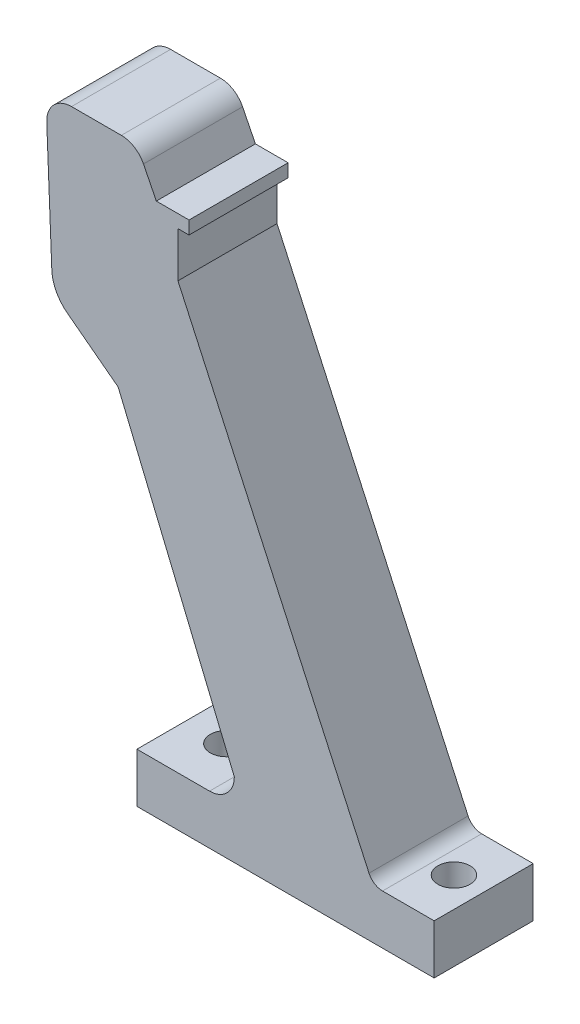
ISO-10303-21;
HEADER;
FILE_DESCRIPTION(('STEP AP214'),'2;1');
FILE_NAME('part.step','',(''),(''),'','','');
FILE_SCHEMA(('AUTOMOTIVE_DESIGN { 1 0 10303 214 1 1 1 1 }'));
ENDSEC;
DATA;
#1=APPLICATION_CONTEXT('core data for automotive mechanical design processes');
#2=APPLICATION_PROTOCOL_DEFINITION('international standard','automotive_design',2000,#1);
#3=PRODUCT_CONTEXT('',#1,'mechanical');
#4=PRODUCT('Part','Part','',(#3));
#5=PRODUCT_RELATED_PRODUCT_CATEGORY('part','',(#4));
#6=PRODUCT_DEFINITION_FORMATION('','',#4);
#7=PRODUCT_DEFINITION_CONTEXT('part definition',#1,'design');
#8=PRODUCT_DEFINITION('design','',#6,#7);
#9=PRODUCT_DEFINITION_SHAPE('','',#8);
#10=(LENGTH_UNIT() NAMED_UNIT(*) SI_UNIT(.MILLI.,.METRE.));
#11=(NAMED_UNIT(*) PLANE_ANGLE_UNIT() SI_UNIT($,.RADIAN.));
#12=(NAMED_UNIT(*) SI_UNIT($,.STERADIAN.) SOLID_ANGLE_UNIT());
#13=UNCERTAINTY_MEASURE_WITH_UNIT(LENGTH_MEASURE(1.E-05),#10,'distance_accuracy_value','');
#14=(GEOMETRIC_REPRESENTATION_CONTEXT(3) GLOBAL_UNCERTAINTY_ASSIGNED_CONTEXT((#13)) GLOBAL_UNIT_ASSIGNED_CONTEXT((#10,
#11,#12)) REPRESENTATION_CONTEXT('',''));
#15=CARTESIAN_POINT('',(0.,0.,0.));
#16=DIRECTION('',(0.,0.,1.));
#17=DIRECTION('',(1.,0.,0.));
#18=AXIS2_PLACEMENT_3D('',#15,#16,#17);
#19=CARTESIAN_POINT('',(-33.5766124042696,62.9247343392549,20.));
#20=DIRECTION('',(0.,-1.,0.));
#21=DIRECTION('',(0.,0.,-1.));
#22=AXIS2_PLACEMENT_3D('',#19,#20,#21);
#23=PLANE('',#22);
#24=DIRECTION('',(-1.,0.,0.));
#25=VECTOR('',#24,1.);
#26=CARTESIAN_POINT('',(-33.5766124042696,62.9247343392549,0.));
#27=LINE('',#26,#25);
#28=CARTESIAN_POINT('',(-33.5766124042696,62.9247343392549,0.));
#29=VERTEX_POINT('',#28);
#30=CARTESIAN_POINT('',(-40.1808506791248,62.9247343392549,0.));
#31=VERTEX_POINT('',#30);
#32=EDGE_CURVE('E202',#29,#31,#27,.T.);
#33=ORIENTED_EDGE('',*,*,#32,.T.);
#34=DIRECTION('',(0.,0.,-1.));
#35=VECTOR('',#34,1.);
#36=CARTESIAN_POINT('',(-40.1808506791248,62.9247343392549,20.));
#37=LINE('',#36,#35);
#38=CARTESIAN_POINT('',(-40.1808506791248,62.9247343392549,20.));
#39=VERTEX_POINT('',#38);
#40=EDGE_CURVE('E11',#39,#31,#37,.T.);
#41=ORIENTED_EDGE('',*,*,#40,.F.);
#42=DIRECTION('',(-1.,0.,0.));
#43=VECTOR('',#42,1.);
#44=CARTESIAN_POINT('',(-33.5766124042696,62.9247343392549,20.));
#45=LINE('',#44,#43);
#46=CARTESIAN_POINT('',(-33.5766124042696,62.9247343392549,20.));
#47=VERTEX_POINT('',#46);
#48=EDGE_CURVE('E242',#47,#39,#45,.T.);
#49=ORIENTED_EDGE('',*,*,#48,.F.);
#50=DIRECTION('',(0.,0.,-1.));
#51=VECTOR('',#50,1.);
#52=CARTESIAN_POINT('',(-33.5766124042696,62.9247343392549,20.));
#53=LINE('',#52,#51);
#54=EDGE_CURVE('E198',#47,#29,#53,.T.);
#55=ORIENTED_EDGE('',*,*,#54,.T.);
#56=EDGE_LOOP('',(#33,#41,#49,#55));
#57=FACE_BOUND('',#56,.T.);
#58=ADVANCED_FACE('F32',(#57),#23,.F.);
#59=CARTESIAN_POINT('',(-42.7703694840836,68.1179503494172,20.));
#60=DIRECTION('',(-0.894915312548847,-0.446236017557525,0.));
#61=DIRECTION('',(0.446236017557525,-0.894915312548847,0.));
#62=AXIS2_PLACEMENT_3D('',#59,#60,#61);
#63=PLANE('',#62);
#64=DIRECTION('',(-0.446236017557525,0.894915312548847,0.));
#65=VECTOR('',#64,1.);
#66=CARTESIAN_POINT('',(-42.7703694840836,68.1179503494172,0.));
#67=LINE('',#66,#65);
#68=CARTESIAN_POINT('',(-42.7703694840836,68.1179503494172,0.));
#69=VERTEX_POINT('',#68);
#70=EDGE_CURVE('E205',#31,#69,#67,.T.);
#71=ORIENTED_EDGE('',*,*,#70,.T.);
#72=DIRECTION('',(0.,0.,-1.));
#73=VECTOR('',#72,1.);
#74=CARTESIAN_POINT('',(-42.7703694840836,68.1179503494172,20.));
#75=LINE('',#74,#73);
#76=CARTESIAN_POINT('',(-42.7703694840836,68.1179503494172,20.));
#77=VERTEX_POINT('',#76);
#78=EDGE_CURVE('E41',#77,#69,#75,.T.);
#79=ORIENTED_EDGE('',*,*,#78,.F.);
#80=DIRECTION('',(-0.446236017557525,0.894915312548847,0.));
#81=VECTOR('',#80,1.);
#82=CARTESIAN_POINT('',(-42.7703694840836,68.1179503494172,20.));
#83=LINE('',#82,#81);
#84=EDGE_CURVE('E129',#39,#77,#83,.T.);
#85=ORIENTED_EDGE('',*,*,#84,.F.);
#86=ORIENTED_EDGE('',*,*,#40,.T.);
#87=EDGE_LOOP('',(#71,#79,#85,#86));
#88=FACE_BOUND('',#87,.T.);
#89=ADVANCED_FACE('F359',(#88),#63,.F.);
#90=CARTESIAN_POINT('',(-47.2449460468278,65.8867702616295,20.));
#91=DIRECTION('',(0.,0.,-1.));
#92=DIRECTION('',(-1.,0.,0.));
#93=AXIS2_PLACEMENT_3D('',#90,#91,#92);
#94=CYLINDRICAL_SURFACE('',#93,5.00000000000001);
#95=CARTESIAN_POINT('',(-47.2449460468278,65.8867702616295,0.));
#96=DIRECTION('',(0.,0.,1.));
#97=DIRECTION('',(-1.,0.,0.));
#98=AXIS2_PLACEMENT_3D('',#95,#96,#97);
#99=CIRCLE('',#98,5.00000000000001);
#100=CARTESIAN_POINT('',(-47.2449460468278,70.8867702616295,0.));
#101=VERTEX_POINT('',#100);
#102=EDGE_CURVE('E208',#69,#101,#99,.T.);
#103=ORIENTED_EDGE('',*,*,#102,.T.);
#104=DIRECTION('',(0.,0.,-1.));
#105=VECTOR('',#104,1.);
#106=CARTESIAN_POINT('',(-47.2449460468278,70.8867702616295,20.));
#107=LINE('',#106,#105);
#108=CARTESIAN_POINT('',(-47.2449460468278,70.8867702616295,20.));
#109=VERTEX_POINT('',#108);
#110=EDGE_CURVE('E285',#109,#101,#107,.T.);
#111=ORIENTED_EDGE('',*,*,#110,.F.);
#112=CARTESIAN_POINT('',(-47.2449460468278,65.8867702616295,20.));
#113=DIRECTION('',(0.,0.,1.));
#114=DIRECTION('',(-1.,0.,0.));
#115=AXIS2_PLACEMENT_3D('',#112,#113,#114);
#116=CIRCLE('',#115,5.00000000000001);
#117=EDGE_CURVE('E304',#77,#109,#116,.T.);
#118=ORIENTED_EDGE('',*,*,#117,.F.);
#119=ORIENTED_EDGE('',*,*,#78,.T.);
#120=EDGE_LOOP('',(#103,#111,#118,#119));
#121=FACE_BOUND('',#120,.T.);
#122=ADVANCED_FACE('F363',(#121),#94,.T.);
#123=CARTESIAN_POINT('',(-57.3006603126146,70.8867702616295,20.));
#124=DIRECTION('',(0.,-1.,0.));
#125=DIRECTION('',(0.,0.,-1.));
#126=AXIS2_PLACEMENT_3D('',#123,#124,#125);
#127=PLANE('',#126);
#128=DIRECTION('',(-1.,0.,0.));
#129=VECTOR('',#128,1.);
#130=CARTESIAN_POINT('',(-57.3006603126146,70.8867702616295,0.));
#131=LINE('',#130,#129);
#132=CARTESIAN_POINT('',(-57.3006603126146,70.8867702616295,0.));
#133=VERTEX_POINT('',#132);
#134=EDGE_CURVE('E210',#101,#133,#131,.T.);
#135=ORIENTED_EDGE('',*,*,#134,.T.);
#136=DIRECTION('',(0.,0.,-1.));
#137=VECTOR('',#136,1.);
#138=CARTESIAN_POINT('',(-57.3006603126146,70.8867702616295,20.));
#139=LINE('',#138,#137);
#140=CARTESIAN_POINT('',(-57.3006603126146,70.8867702616295,20.));
#141=VERTEX_POINT('',#140);
#142=EDGE_CURVE('E282',#141,#133,#139,.T.);
#143=ORIENTED_EDGE('',*,*,#142,.F.);
#144=DIRECTION('',(-1.,0.,0.));
#145=VECTOR('',#144,1.);
#146=CARTESIAN_POINT('',(-57.3006603126146,70.8867702616295,20.));
#147=LINE('',#146,#145);
#148=EDGE_CURVE('E306',#109,#141,#147,.T.);
#149=ORIENTED_EDGE('',*,*,#148,.F.);
#150=ORIENTED_EDGE('',*,*,#110,.T.);
#151=EDGE_LOOP('',(#135,#143,#149,#150));
#152=FACE_BOUND('',#151,.T.);
#153=ADVANCED_FACE('F367',(#152),#127,.F.);
#154=CARTESIAN_POINT('',(-57.3006603126146,65.8867702616295,20.));
#155=DIRECTION('',(0.,0.,-1.));
#156=DIRECTION('',(-1.,0.,0.));
#157=AXIS2_PLACEMENT_3D('',#154,#155,#156);
#158=CYLINDRICAL_SURFACE('',#157,5.);
#159=CARTESIAN_POINT('',(-57.3006603126146,65.8867702616295,0.));
#160=DIRECTION('',(0.,0.,1.));
#161=DIRECTION('',(-1.,0.,0.));
#162=AXIS2_PLACEMENT_3D('',#159,#160,#161);
#163=CIRCLE('',#162,5.);
#164=CARTESIAN_POINT('',(-62.2966311792775,65.6860836914358,0.));
#165=VERTEX_POINT('',#164);
#166=EDGE_CURVE('E212',#133,#165,#163,.T.);
#167=ORIENTED_EDGE('',*,*,#166,.T.);
#168=DIRECTION('',(0.,0.,-1.));
#169=VECTOR('',#168,1.);
#170=CARTESIAN_POINT('',(-62.2966311792775,65.6860836914358,20.));
#171=LINE('',#170,#169);
#172=CARTESIAN_POINT('',(-62.2966311792775,65.6860836914358,20.));
#173=VERTEX_POINT('',#172);
#174=EDGE_CURVE('E279',#173,#165,#171,.T.);
#175=ORIENTED_EDGE('',*,*,#174,.F.);
#176=CARTESIAN_POINT('',(-57.3006603126146,65.8867702616295,20.));
#177=DIRECTION('',(0.,0.,1.));
#178=DIRECTION('',(-1.,0.,0.));
#179=AXIS2_PLACEMENT_3D('',#176,#177,#178);
#180=CIRCLE('',#179,5.);
#181=EDGE_CURVE('E308',#141,#173,#180,.T.);
#182=ORIENTED_EDGE('',*,*,#181,.F.);
#183=ORIENTED_EDGE('',*,*,#142,.T.);
#184=EDGE_LOOP('',(#167,#175,#182,#183));
#185=FACE_BOUND('',#184,.T.);
#186=ADVANCED_FACE('F373',(#185),#158,.T.);
#187=CARTESIAN_POINT('',(-61.2932112276318,40.7065504789688,20.));
#188=DIRECTION('',(0.999194173332569,0.0401373140387434,0.));
#189=DIRECTION('',(-0.0401373140387434,0.999194173332569,0.));
#190=AXIS2_PLACEMENT_3D('',#187,#188,#189);
#191=PLANE('',#190);
#192=DIRECTION('',(0.0401373140387434,-0.999194173332569,0.));
#193=VECTOR('',#192,1.);
#194=CARTESIAN_POINT('',(-61.2932112276318,40.7065504789688,0.));
#195=LINE('',#194,#193);
#196=CARTESIAN_POINT('',(-61.2932112276318,40.7065504789688,0.));
#197=VERTEX_POINT('',#196);
#198=EDGE_CURVE('E214',#165,#197,#195,.T.);
#199=ORIENTED_EDGE('',*,*,#198,.T.);
#200=DIRECTION('',(0.,0.,-1.));
#201=VECTOR('',#200,1.);
#202=CARTESIAN_POINT('',(-61.2932112276318,40.7065504789688,20.));
#203=LINE('',#202,#201);
#204=CARTESIAN_POINT('',(-61.2932112276318,40.7065504789688,20.));
#205=VERTEX_POINT('',#204);
#206=EDGE_CURVE('E276',#205,#197,#203,.T.);
#207=ORIENTED_EDGE('',*,*,#206,.F.);
#208=DIRECTION('',(0.0401373140387434,-0.999194173332569,0.));
#209=VECTOR('',#208,1.);
#210=CARTESIAN_POINT('',(-61.2932112276318,40.7065504789688,20.));
#211=LINE('',#210,#209);
#212=EDGE_CURVE('E310',#173,#205,#211,.T.);
#213=ORIENTED_EDGE('',*,*,#212,.F.);
#214=ORIENTED_EDGE('',*,*,#174,.T.);
#215=EDGE_LOOP('',(#199,#207,#213,#214));
#216=FACE_BOUND('',#215,.T.);
#217=ADVANCED_FACE('F377',(#216),#191,.F.);
#218=CARTESIAN_POINT('',(-53.3327114021717,40.7065504789688,20.));
#219=DIRECTION('',(0.,0.,-1.));
#220=DIRECTION('',(-1.,0.,0.));
#221=AXIS2_PLACEMENT_3D('',#218,#219,#220);
#222=CYLINDRICAL_SURFACE('',#221,7.9604998254601);
#223=CARTESIAN_POINT('',(-53.3327114021717,40.7065504789688,0.));
#224=DIRECTION('',(0.,0.,1.));
#225=DIRECTION('',(1.,0.,0.));
#226=AXIS2_PLACEMENT_3D('',#223,#224,#225);
#227=CIRCLE('',#226,7.9604998254601);
#228=CARTESIAN_POINT('',(-58.1484141349181,34.3678941023406,0.));
#229=VERTEX_POINT('',#228);
#230=EDGE_CURVE('E216',#197,#229,#227,.T.);
#231=ORIENTED_EDGE('',*,*,#230,.T.);
#232=DIRECTION('',(0.,0.,-1.));
#233=VECTOR('',#232,1.);
#234=CARTESIAN_POINT('',(-58.1484141349181,34.3678941023406,20.));
#235=LINE('',#234,#233);
#236=CARTESIAN_POINT('',(-58.1484141349181,34.3678941023406,20.));
#237=VERTEX_POINT('',#236);
#238=EDGE_CURVE('E273',#237,#229,#235,.T.);
#239=ORIENTED_EDGE('',*,*,#238,.F.);
#240=CARTESIAN_POINT('',(-53.3327114021717,40.7065504789688,20.));
#241=DIRECTION('',(0.,0.,1.));
#242=DIRECTION('',(1.,0.,0.));
#243=AXIS2_PLACEMENT_3D('',#240,#241,#242);
#244=CIRCLE('',#243,7.9604998254601);
#245=EDGE_CURVE('E312',#205,#237,#244,.T.);
#246=ORIENTED_EDGE('',*,*,#245,.F.);
#247=ORIENTED_EDGE('',*,*,#206,.T.);
#248=EDGE_LOOP('',(#231,#239,#246,#247));
#249=FACE_BOUND('',#248,.T.);
#250=ADVANCED_FACE('F381',(#249),#222,.T.);
#251=CARTESIAN_POINT('',(-58.1484141349181,34.3678941023406,20.));
#252=DIRECTION('',(0.604949794401637,0.796263616055271,0.));
#253=DIRECTION('',(-0.796263616055271,0.604949794401637,0.));
#254=AXIS2_PLACEMENT_3D('',#251,#252,#253);
#255=PLANE('',#254);
#256=DIRECTION('',(0.796263616055272,-0.604949794401637,0.));
#257=VECTOR('',#256,1.);
#258=CARTESIAN_POINT('',(-58.1484141349181,34.3678941023406,0.));
#259=LINE('',#258,#257);
#260=CARTESIAN_POINT('',(-47.8780871903336,26.565161378794,0.));
#261=VERTEX_POINT('',#260);
#262=EDGE_CURVE('E218',#229,#261,#259,.T.);
#263=ORIENTED_EDGE('',*,*,#262,.T.);
#264=DIRECTION('',(0.,0.,-1.));
#265=VECTOR('',#264,1.);
#266=CARTESIAN_POINT('',(-47.8780871903336,26.565161378794,20.));
#267=LINE('',#266,#265);
#268=CARTESIAN_POINT('',(-47.8780871903336,26.565161378794,20.));
#269=VERTEX_POINT('',#268);
#270=EDGE_CURVE('E270',#269,#261,#267,.T.);
#271=ORIENTED_EDGE('',*,*,#270,.F.);
#272=DIRECTION('',(0.796263616055272,-0.604949794401637,0.));
#273=VECTOR('',#272,1.);
#274=CARTESIAN_POINT('',(-58.1484141349181,34.3678941023406,20.));
#275=LINE('',#274,#273);
#276=EDGE_CURVE('E314',#237,#269,#275,.T.);
#277=ORIENTED_EDGE('',*,*,#276,.F.);
#278=ORIENTED_EDGE('',*,*,#238,.T.);
#279=EDGE_LOOP('',(#263,#271,#277,#278));
#280=FACE_BOUND('',#279,.T.);
#281=ADVANCED_FACE('F385',(#280),#255,.F.);
#282=CARTESIAN_POINT('',(-47.8780871903336,26.565161378794,20.));
#283=DIRECTION('',(0.923463347076274,0.383686651587837,0.));
#284=DIRECTION('',(-0.383686651587837,0.923463347076274,0.));
#285=AXIS2_PLACEMENT_3D('',#282,#283,#284);
#286=PLANE('',#285);
#287=DIRECTION('',(0.383686651587837,-0.923463347076273,0.));
#288=VECTOR('',#287,1.);
#289=CARTESIAN_POINT('',(-47.8780871903336,26.565161378794,0.));
#290=LINE('',#289,#288);
#291=CARTESIAN_POINT('',(-24.4383016097653,-29.850100286952,0.));
#292=VERTEX_POINT('',#291);
#293=EDGE_CURVE('E220',#261,#292,#290,.T.);
#294=ORIENTED_EDGE('',*,*,#293,.T.);
#295=DIRECTION('',(0.,0.,-1.));
#296=VECTOR('',#295,1.);
#297=CARTESIAN_POINT('',(-24.4383016097653,-29.850100286952,20.));
#298=LINE('',#297,#296);
#299=CARTESIAN_POINT('',(-24.4383016097653,-29.850100286952,20.));
#300=VERTEX_POINT('',#299);
#301=EDGE_CURVE('E267',#300,#292,#298,.T.);
#302=ORIENTED_EDGE('',*,*,#301,.F.);
#303=DIRECTION('',(0.383686651587837,-0.923463347076273,0.));
#304=VECTOR('',#303,1.);
#305=CARTESIAN_POINT('',(-47.8780871903336,26.565161378794,20.));
#306=LINE('',#305,#304);
#307=EDGE_CURVE('E316',#269,#300,#306,.T.);
#308=ORIENTED_EDGE('',*,*,#307,.F.);
#309=ORIENTED_EDGE('',*,*,#270,.T.);
#310=EDGE_LOOP('',(#294,#302,#308,#309));
#311=FACE_BOUND('',#310,.T.);
#312=ADVANCED_FACE('F389',(#311),#286,.F.);
#313=CARTESIAN_POINT('',(-29.4383016097653,-29.8501002869519,20.));
#314=DIRECTION('',(0.,0.,-1.));
#315=DIRECTION('',(-1.,0.,0.));
#316=AXIS2_PLACEMENT_3D('',#313,#314,#315);
#317=CYLINDRICAL_SURFACE('',#316,5.);
#318=CARTESIAN_POINT('',(-29.4383016097653,-29.8501002869519,0.));
#319=DIRECTION('',(0.,0.,-1.));
#320=DIRECTION('',(-1.,0.,0.));
#321=AXIS2_PLACEMENT_3D('',#318,#319,#320);
#322=CIRCLE('',#321,5.);
#323=CARTESIAN_POINT('',(-29.4383016097653,-34.8501002869519,0.));
#324=VERTEX_POINT('',#323);
#325=EDGE_CURVE('E222',#292,#324,#322,.T.);
#326=ORIENTED_EDGE('',*,*,#325,.T.);
#327=DIRECTION('',(0.,0.,-1.));
#328=VECTOR('',#327,1.);
#329=CARTESIAN_POINT('',(-29.4383016097653,-34.8501002869519,20.));
#330=LINE('',#329,#328);
#331=CARTESIAN_POINT('',(-29.4383016097653,-34.8501002869519,20.));
#332=VERTEX_POINT('',#331);
#333=EDGE_CURVE('E264',#332,#324,#330,.T.);
#334=ORIENTED_EDGE('',*,*,#333,.F.);
#335=CARTESIAN_POINT('',(-29.4383016097653,-29.8501002869519,20.));
#336=DIRECTION('',(0.,0.,-1.));
#337=DIRECTION('',(-1.,0.,0.));
#338=AXIS2_PLACEMENT_3D('',#335,#336,#337);
#339=CIRCLE('',#338,5.);
#340=EDGE_CURVE('E318',#300,#332,#339,.T.);
#341=ORIENTED_EDGE('',*,*,#340,.F.);
#342=ORIENTED_EDGE('',*,*,#301,.T.);
#343=EDGE_LOOP('',(#326,#334,#341,#342));
#344=FACE_BOUND('',#343,.T.);
#345=ADVANCED_FACE('F393',(#344),#317,.F.);
#346=CARTESIAN_POINT('',(-35.9155345933977,-34.8501002869519,20.));
#347=DIRECTION('',(0.,-1.,0.));
#348=DIRECTION('',(0.,0.,-1.));
#349=AXIS2_PLACEMENT_3D('',#346,#347,#348);
#350=PLANE('',#349);
#351=CARTESIAN_POINT('',(-36.0384333161935,-34.8501002869519,10.));
#352=DIRECTION('',(0.,-1.,0.));
#353=DIRECTION('',(0.,0.,-1.));
#354=AXIS2_PLACEMENT_3D('',#351,#352,#353);
#355=CIRCLE('',#354,3.25);
#356=CARTESIAN_POINT('',(-36.0384333161935,-34.8501002869519,6.75));
#357=VERTEX_POINT('',#356);
#358=EDGE_CURVE('E206',#357,#357,#355,.F.);
#359=ORIENTED_EDGE('',*,*,#358,.F.);
#360=EDGE_LOOP('',(#359));
#361=FACE_BOUND('',#360,.T.);
#362=DIRECTION('',(-1.,0.,0.));
#363=VECTOR('',#362,1.);
#364=CARTESIAN_POINT('',(-35.9155345933977,-34.8501002869519,0.));
#365=LINE('',#364,#363);
#366=CARTESIAN_POINT('',(-44.0977920787304,-34.8501002869519,0.));
#367=VERTEX_POINT('',#366);
#368=EDGE_CURVE('E225',#324,#367,#365,.T.);
#369=ORIENTED_EDGE('',*,*,#368,.T.);
#370=DIRECTION('',(0.,0.,-1.));
#371=VECTOR('',#370,1.);
#372=CARTESIAN_POINT('',(-44.0977920787304,-34.8501002869519,20.));
#373=LINE('',#372,#371);
#374=CARTESIAN_POINT('',(-44.0977920787304,-34.8501002869519,20.));
#375=VERTEX_POINT('',#374);
#376=EDGE_CURVE('E261',#375,#367,#373,.T.);
#377=ORIENTED_EDGE('',*,*,#376,.F.);
#378=DIRECTION('',(-1.,0.,0.));
#379=VECTOR('',#378,1.);
#380=CARTESIAN_POINT('',(-29.4383016097653,-34.8501002869519,20.));
#381=LINE('',#380,#379);
#382=EDGE_CURVE('E320',#332,#375,#381,.T.);
#383=ORIENTED_EDGE('',*,*,#382,.F.);
#384=ORIENTED_EDGE('',*,*,#333,.T.);
#385=EDGE_LOOP('',(#369,#377,#383,#384));
#386=FACE_BOUND('',#385,.T.);
#387=ADVANCED_FACE('F397',(#361,#386),#350,.F.);
#388=CARTESIAN_POINT('',(-44.0977920787304,-34.8501002869519,20.));
#389=DIRECTION('',(1.,0.,0.));
#390=DIRECTION('',(0.,0.,-1.));
#391=AXIS2_PLACEMENT_3D('',#388,#389,#390);
#392=PLANE('',#391);
#393=DIRECTION('',(0.,-1.,0.));
#394=VECTOR('',#393,1.);
#395=CARTESIAN_POINT('',(-44.0977920787304,-34.8501002869519,0.));
#396=LINE('',#395,#394);
#397=CARTESIAN_POINT('',(-44.0977920787304,-44.8501002869519,0.));
#398=VERTEX_POINT('',#397);
#399=EDGE_CURVE('E227',#367,#398,#396,.T.);
#400=ORIENTED_EDGE('',*,*,#399,.T.);
#401=DIRECTION('',(0.,0.,-1.));
#402=VECTOR('',#401,1.);
#403=CARTESIAN_POINT('',(-44.0977920787304,-44.8501002869519,20.));
#404=LINE('',#403,#402);
#405=CARTESIAN_POINT('',(-44.0977920787304,-44.8501002869519,20.));
#406=VERTEX_POINT('',#405);
#407=EDGE_CURVE('E258',#406,#398,#404,.T.);
#408=ORIENTED_EDGE('',*,*,#407,.F.);
#409=DIRECTION('',(0.,-1.,0.));
#410=VECTOR('',#409,1.);
#411=CARTESIAN_POINT('',(-44.0977920787304,-34.8501002869519,20.));
#412=LINE('',#411,#410);
#413=EDGE_CURVE('E322',#375,#406,#412,.T.);
#414=ORIENTED_EDGE('',*,*,#413,.F.);
#415=ORIENTED_EDGE('',*,*,#376,.T.);
#416=EDGE_LOOP('',(#400,#408,#414,#415));
#417=FACE_BOUND('',#416,.T.);
#418=ADVANCED_FACE('F401',(#417),#392,.F.);
#419=CARTESIAN_POINT('',(-44.0977920787304,-44.8501002869519,20.));
#420=DIRECTION('',(0.,1.,0.));
#421=DIRECTION('',(-1.,0.,0.));
#422=AXIS2_PLACEMENT_3D('',#419,#420,#421);
#423=PLANE('',#422);
#424=CARTESIAN_POINT('',(9.90219164378535,-44.8501002869519,10.));
#425=DIRECTION('',(0.,1.,0.));
#426=DIRECTION('',(-1.,0.,0.));
#427=AXIS2_PLACEMENT_3D('',#424,#425,#426);
#428=CIRCLE('',#427,3.25000000029061);
#429=CARTESIAN_POINT('',(6.65219164349474,-44.8501002869519,10.));
#430=VERTEX_POINT('',#429);
#431=EDGE_CURVE('E291',#430,#430,#428,.F.);
#432=ORIENTED_EDGE('',*,*,#431,.F.);
#433=EDGE_LOOP('',(#432));
#434=FACE_BOUND('',#433,.T.);
#435=CARTESIAN_POINT('',(-36.0384333161935,-44.8501002869519,10.));
#436=DIRECTION('',(0.,1.,0.));
#437=DIRECTION('',(-1.,0.,0.));
#438=AXIS2_PLACEMENT_3D('',#435,#436,#437);
#439=CIRCLE('',#438,3.25);
#440=CARTESIAN_POINT('',(-39.2884333161935,-44.8501002869519,10.));
#441=VERTEX_POINT('',#440);
#442=EDGE_CURVE('E35',#441,#441,#439,.F.);
#443=ORIENTED_EDGE('',*,*,#442,.F.);
#444=EDGE_LOOP('',(#443));
#445=FACE_BOUND('',#444,.T.);
#446=DIRECTION('',(1.,0.,0.));
#447=VECTOR('',#446,1.);
#448=CARTESIAN_POINT('',(-44.0977920787304,-44.8501002869519,0.));
#449=LINE('',#448,#447);
#450=CARTESIAN_POINT('',(15.9021916437853,-44.8501002869519,0.));
#451=VERTEX_POINT('',#450);
#452=EDGE_CURVE('E229',#398,#451,#449,.T.);
#453=ORIENTED_EDGE('',*,*,#452,.T.);
#454=DIRECTION('',(0.,0.,-1.));
#455=VECTOR('',#454,1.);
#456=CARTESIAN_POINT('',(15.9021916437853,-44.8501002869519,20.));
#457=LINE('',#456,#455);
#458=CARTESIAN_POINT('',(15.9021916437853,-44.8501002869519,20.));
#459=VERTEX_POINT('',#458);
#460=EDGE_CURVE('E255',#459,#451,#457,.T.);
#461=ORIENTED_EDGE('',*,*,#460,.F.);
#462=DIRECTION('',(1.,0.,0.));
#463=VECTOR('',#462,1.);
#464=CARTESIAN_POINT('',(-44.0977920787304,-44.8501002869519,20.));
#465=LINE('',#464,#463);
#466=EDGE_CURVE('E324',#406,#459,#465,.T.);
#467=ORIENTED_EDGE('',*,*,#466,.F.);
#468=ORIENTED_EDGE('',*,*,#407,.T.);
#469=EDGE_LOOP('',(#453,#461,#467,#468));
#470=FACE_BOUND('',#469,.T.);
#471=ADVANCED_FACE('F405',(#434,#445,#470),#423,.F.);
#472=CARTESIAN_POINT('',(15.9021916437853,-44.8501002869519,20.));
#473=DIRECTION('',(-1.,0.,0.));
#474=DIRECTION('',(0.,0.,1.));
#475=AXIS2_PLACEMENT_3D('',#472,#473,#474);
#476=PLANE('',#475);
#477=DIRECTION('',(0.,1.,0.));
#478=VECTOR('',#477,1.);
#479=CARTESIAN_POINT('',(15.9021916437853,-44.8501002869519,0.));
#480=LINE('',#479,#478);
#481=CARTESIAN_POINT('',(15.9021916437853,-34.8501002869519,0.));
#482=VERTEX_POINT('',#481);
#483=EDGE_CURVE('E231',#451,#482,#480,.T.);
#484=ORIENTED_EDGE('',*,*,#483,.T.);
#485=DIRECTION('',(0.,0.,-1.));
#486=VECTOR('',#485,1.);
#487=CARTESIAN_POINT('',(15.9021916437853,-34.8501002869519,20.));
#488=LINE('',#487,#486);
#489=CARTESIAN_POINT('',(15.9021916437853,-34.8501002869519,20.));
#490=VERTEX_POINT('',#489);
#491=EDGE_CURVE('E252',#490,#482,#488,.T.);
#492=ORIENTED_EDGE('',*,*,#491,.F.);
#493=DIRECTION('',(0.,1.,0.));
#494=VECTOR('',#493,1.);
#495=CARTESIAN_POINT('',(15.9021916437853,-44.8501002869519,20.));
#496=LINE('',#495,#494);
#497=EDGE_CURVE('E326',#459,#490,#496,.T.);
#498=ORIENTED_EDGE('',*,*,#497,.F.);
#499=ORIENTED_EDGE('',*,*,#460,.T.);
#500=EDGE_LOOP('',(#484,#492,#498,#499));
#501=FACE_BOUND('',#500,.T.);
#502=ADVANCED_FACE('F409',(#501),#476,.F.);
#503=CARTESIAN_POINT('',(15.9021916437853,-34.8501002869519,20.));
#504=DIRECTION('',(0.,-1.,0.));
#505=DIRECTION('',(1.,0.,0.));
#506=AXIS2_PLACEMENT_3D('',#503,#504,#505);
#507=PLANE('',#506);
#508=CARTESIAN_POINT('',(9.90219164378535,-34.8501002869519,10.));
#509=DIRECTION('',(0.,-1.,0.));
#510=DIRECTION('',(1.,0.,0.));
#511=AXIS2_PLACEMENT_3D('',#508,#509,#510);
#512=CIRCLE('',#511,3.25000000029061);
#513=CARTESIAN_POINT('',(13.152191644076,-34.8501002869519,10.));
#514=VERTEX_POINT('',#513);
#515=EDGE_CURVE('E289',#514,#514,#512,.F.);
#516=ORIENTED_EDGE('',*,*,#515,.F.);
#517=EDGE_LOOP('',(#516));
#518=FACE_BOUND('',#517,.T.);
#519=DIRECTION('',(-1.,0.,0.));
#520=VECTOR('',#519,1.);
#521=CARTESIAN_POINT('',(15.9021916437853,-34.8501002869519,0.));
#522=LINE('',#521,#520);
#523=CARTESIAN_POINT('',(5.48183767946882,-34.850100286952,0.));
#524=VERTEX_POINT('',#523);
#525=EDGE_CURVE('E233',#482,#524,#522,.T.);
#526=ORIENTED_EDGE('',*,*,#525,.T.);
#527=DIRECTION('',(0.,0.,-1.));
#528=VECTOR('',#527,1.);
#529=CARTESIAN_POINT('',(5.48183767946882,-34.850100286952,20.));
#530=LINE('',#529,#528);
#531=CARTESIAN_POINT('',(5.48183767946882,-34.850100286952,20.));
#532=VERTEX_POINT('',#531);
#533=EDGE_CURVE('E249',#532,#524,#530,.T.);
#534=ORIENTED_EDGE('',*,*,#533,.F.);
#535=DIRECTION('',(-1.,0.,0.));
#536=VECTOR('',#535,1.);
#537=CARTESIAN_POINT('',(15.9021916437853,-34.8501002869519,20.));
#538=LINE('',#537,#536);
#539=EDGE_CURVE('E328',#490,#532,#538,.T.);
#540=ORIENTED_EDGE('',*,*,#539,.F.);
#541=ORIENTED_EDGE('',*,*,#491,.T.);
#542=EDGE_LOOP('',(#526,#534,#540,#541));
#543=FACE_BOUND('',#542,.T.);
#544=ADVANCED_FACE('F413',(#518,#543),#507,.F.);
#545=CARTESIAN_POINT('',(5.4818376794688,-31.850100286952,20.));
#546=DIRECTION('',(0.,0.,-1.));
#547=DIRECTION('',(-1.,0.,0.));
#548=AXIS2_PLACEMENT_3D('',#545,#546,#547);
#549=CYLINDRICAL_SURFACE('',#548,3.);
#550=CARTESIAN_POINT('',(5.4818376794688,-31.850100286952,0.));
#551=DIRECTION('',(0.,0.,-1.));
#552=DIRECTION('',(-1.,0.,0.));
#553=AXIS2_PLACEMENT_3D('',#550,#551,#552);
#554=CIRCLE('',#553,3.);
#555=CARTESIAN_POINT('',(2.75399471234341,-33.0986485426091,0.));
#556=VERTEX_POINT('',#555);
#557=EDGE_CURVE('E235',#524,#556,#554,.T.);
#558=ORIENTED_EDGE('',*,*,#557,.T.);
#559=DIRECTION('',(0.,0.,-1.));
#560=VECTOR('',#559,1.);
#561=CARTESIAN_POINT('',(2.75399471234341,-33.0986485426091,20.));
#562=LINE('',#561,#560);
#563=CARTESIAN_POINT('',(2.75399471234341,-33.0986485426091,20.));
#564=VERTEX_POINT('',#563);
#565=EDGE_CURVE('E246',#564,#556,#562,.T.);
#566=ORIENTED_EDGE('',*,*,#565,.F.);
#567=CARTESIAN_POINT('',(5.4818376794688,-31.850100286952,20.));
#568=DIRECTION('',(0.,0.,-1.));
#569=DIRECTION('',(-1.,0.,0.));
#570=AXIS2_PLACEMENT_3D('',#567,#568,#569);
#571=CIRCLE('',#570,3.);
#572=EDGE_CURVE('E330',#532,#564,#571,.T.);
#573=ORIENTED_EDGE('',*,*,#572,.F.);
#574=ORIENTED_EDGE('',*,*,#533,.T.);
#575=EDGE_LOOP('',(#558,#566,#573,#574));
#576=FACE_BOUND('',#575,.T.);
#577=ADVANCED_FACE('F336',(#576),#549,.F.);
#578=CARTESIAN_POINT('',(-35.8152778583421,51.1679534508464,20.));
#579=DIRECTION('',(-0.909280989041795,-0.416182751885726,0.));
#580=DIRECTION('',(0.416182751885726,-0.909280989041795,0.));
#581=AXIS2_PLACEMENT_3D('',#578,#579,#580);
#582=PLANE('',#581);
#583=DIRECTION('',(-0.416182751885726,0.909280989041795,0.));
#584=VECTOR('',#583,1.);
#585=CARTESIAN_POINT('',(-35.8152778583421,51.1679534508464,0.));
#586=LINE('',#585,#584);
#587=CARTESIAN_POINT('',(-35.8152778583421,51.1679534508464,0.));
#588=VERTEX_POINT('',#587);
#589=EDGE_CURVE('E237',#556,#588,#586,.T.);
#590=ORIENTED_EDGE('',*,*,#589,.T.);
#591=DIRECTION('',(0.,0.,-1.));
#592=VECTOR('',#591,1.);
#593=CARTESIAN_POINT('',(-35.8152778583421,51.1679534508464,20.));
#594=LINE('',#593,#592);
#595=CARTESIAN_POINT('',(-35.8152778583421,51.1679534508464,20.));
#596=VERTEX_POINT('',#595);
#597=EDGE_CURVE('E193',#596,#588,#594,.T.);
#598=ORIENTED_EDGE('',*,*,#597,.F.);
#599=DIRECTION('',(-0.416182751885726,0.909280989041795,0.));
#600=VECTOR('',#599,1.);
#601=CARTESIAN_POINT('',(-35.8152778583421,51.1679534508464,20.));
#602=LINE('',#601,#600);
#603=EDGE_CURVE('E184',#564,#596,#602,.T.);
#604=ORIENTED_EDGE('',*,*,#603,.F.);
#605=ORIENTED_EDGE('',*,*,#565,.T.);
#606=EDGE_LOOP('',(#590,#598,#604,#605));
#607=FACE_BOUND('',#606,.T.);
#608=ADVANCED_FACE('F340',(#607),#582,.F.);
#609=CARTESIAN_POINT('',(-35.8152778583421,51.1679534508464,20.));
#610=DIRECTION('',(-1.,0.,0.));
#611=DIRECTION('',(0.,0.,1.));
#612=AXIS2_PLACEMENT_3D('',#609,#610,#611);
#613=PLANE('',#612);
#614=DIRECTION('',(0.,1.,0.));
#615=VECTOR('',#614,1.);
#616=CARTESIAN_POINT('',(-35.8152778583421,51.1679534508464,0.));
#617=LINE('',#616,#615);
#618=CARTESIAN_POINT('',(-35.8152778583421,60.2919592382552,0.));
#619=VERTEX_POINT('',#618);
#620=EDGE_CURVE('E192',#588,#619,#617,.T.);
#621=ORIENTED_EDGE('',*,*,#620,.T.);
#622=DIRECTION('',(0.,0.,-1.));
#623=VECTOR('',#622,1.);
#624=CARTESIAN_POINT('',(-35.8152778583421,60.2919592382552,20.));
#625=LINE('',#624,#623);
#626=CARTESIAN_POINT('',(-35.8152778583421,60.2919592382552,20.));
#627=VERTEX_POINT('',#626);
#628=EDGE_CURVE('E189',#627,#619,#625,.T.);
#629=ORIENTED_EDGE('',*,*,#628,.F.);
#630=DIRECTION('',(0.,1.,0.));
#631=VECTOR('',#630,1.);
#632=CARTESIAN_POINT('',(-35.8152778583421,51.1679534508464,20.));
#633=LINE('',#632,#631);
#634=EDGE_CURVE('E178',#596,#627,#633,.T.);
#635=ORIENTED_EDGE('',*,*,#634,.F.);
#636=ORIENTED_EDGE('',*,*,#597,.T.);
#637=EDGE_LOOP('',(#621,#629,#635,#636));
#638=FACE_BOUND('',#637,.T.);
#639=ADVANCED_FACE('F190',(#638),#613,.F.);
#640=CARTESIAN_POINT('',(-35.8152778583421,60.2919592382552,20.));
#641=DIRECTION('',(0.,1.,0.));
#642=DIRECTION('',(0.,0.,1.));
#643=AXIS2_PLACEMENT_3D('',#640,#641,#642);
#644=PLANE('',#643);
#645=DIRECTION('',(1.,0.,0.));
#646=VECTOR('',#645,1.);
#647=CARTESIAN_POINT('',(-35.8152778583421,60.2919592382552,0.));
#648=LINE('',#647,#646);
#649=CARTESIAN_POINT('',(-33.5766124042696,60.2919592382552,0.));
#650=VERTEX_POINT('',#649);
#651=EDGE_CURVE('E115',#619,#650,#648,.T.);
#652=ORIENTED_EDGE('',*,*,#651,.T.);
#653=DIRECTION('',(0.,0.,-1.));
#654=VECTOR('',#653,1.);
#655=CARTESIAN_POINT('',(-33.5766124042696,60.2919592382552,20.));
#656=LINE('',#655,#654);
#657=CARTESIAN_POINT('',(-33.5766124042696,60.2919592382552,20.));
#658=VERTEX_POINT('',#657);
#659=EDGE_CURVE('E194',#658,#650,#656,.T.);
#660=ORIENTED_EDGE('',*,*,#659,.F.);
#661=DIRECTION('',(1.,0.,0.));
#662=VECTOR('',#661,1.);
#663=CARTESIAN_POINT('',(-35.8152778583421,60.2919592382552,20.));
#664=LINE('',#663,#662);
#665=EDGE_CURVE('E182',#627,#658,#664,.T.);
#666=ORIENTED_EDGE('',*,*,#665,.F.);
#667=ORIENTED_EDGE('',*,*,#628,.T.);
#668=EDGE_LOOP('',(#652,#660,#666,#667));
#669=FACE_BOUND('',#668,.T.);
#670=ADVANCED_FACE('F196',(#669),#644,.F.);
#671=CARTESIAN_POINT('',(-33.5766124042696,60.2919592382552,20.));
#672=DIRECTION('',(-1.,0.,0.));
#673=DIRECTION('',(0.,-1.,0.));
#674=AXIS2_PLACEMENT_3D('',#671,#672,#673);
#675=PLANE('',#674);
#676=DIRECTION('',(0.,1.,0.));
#677=VECTOR('',#676,1.);
#678=CARTESIAN_POINT('',(-33.5766124042696,60.2919592382552,0.));
#679=LINE('',#678,#677);
#680=EDGE_CURVE('E121',#650,#29,#679,.T.);
#681=ORIENTED_EDGE('',*,*,#680,.T.);
#682=ORIENTED_EDGE('',*,*,#54,.F.);
#683=DIRECTION('',(0.,1.,0.));
#684=VECTOR('',#683,1.);
#685=CARTESIAN_POINT('',(-33.5766124042696,60.2919592382552,20.));
#686=LINE('',#685,#684);
#687=EDGE_CURVE('E50',#658,#47,#686,.T.);
#688=ORIENTED_EDGE('',*,*,#687,.F.);
#689=ORIENTED_EDGE('',*,*,#659,.T.);
#690=EDGE_LOOP('',(#681,#682,#688,#689));
#691=FACE_BOUND('',#690,.T.);
#692=ADVANCED_FACE('F348',(#691),#675,.F.);
#693=CARTESIAN_POINT('',(-47.2449460468278,65.8867702616295,20.));
#694=DIRECTION('',(0.,0.,-1.));
#695=DIRECTION('',(-1.,0.,0.));
#696=AXIS2_PLACEMENT_3D('',#693,#694,#695);
#697=PLANE('',#696);
#698=ORIENTED_EDGE('',*,*,#48,.T.);
#699=ORIENTED_EDGE('',*,*,#84,.T.);
#700=ORIENTED_EDGE('',*,*,#117,.T.);
#701=ORIENTED_EDGE('',*,*,#148,.T.);
#702=ORIENTED_EDGE('',*,*,#181,.T.);
#703=ORIENTED_EDGE('',*,*,#212,.T.);
#704=ORIENTED_EDGE('',*,*,#245,.T.);
#705=ORIENTED_EDGE('',*,*,#276,.T.);
#706=ORIENTED_EDGE('',*,*,#307,.T.);
#707=ORIENTED_EDGE('',*,*,#340,.T.);
#708=ORIENTED_EDGE('',*,*,#382,.T.);
#709=ORIENTED_EDGE('',*,*,#413,.T.);
#710=ORIENTED_EDGE('',*,*,#466,.T.);
#711=ORIENTED_EDGE('',*,*,#497,.T.);
#712=ORIENTED_EDGE('',*,*,#539,.T.);
#713=ORIENTED_EDGE('',*,*,#572,.T.);
#714=ORIENTED_EDGE('',*,*,#603,.T.);
#715=ORIENTED_EDGE('',*,*,#634,.T.);
#716=ORIENTED_EDGE('',*,*,#665,.T.);
#717=ORIENTED_EDGE('',*,*,#687,.T.);
#718=EDGE_LOOP('',(#698,#699,#700,#701,#702,#703,#704,#705,#706,#707,#708,#709,#710,#711,#712,
#713,#714,#715,#716,#717));
#719=FACE_BOUND('',#718,.T.);
#720=ADVANCED_FACE('F180',(#719),#697,.F.);
#721=CARTESIAN_POINT('',(-47.2449460468278,65.8867702616295,0.));
#722=DIRECTION('',(0.,0.,-1.));
#723=DIRECTION('',(-1.,0.,0.));
#724=AXIS2_PLACEMENT_3D('',#721,#722,#723);
#725=PLANE('',#724);
#726=ORIENTED_EDGE('',*,*,#32,.F.);
#727=ORIENTED_EDGE('',*,*,#680,.F.);
#728=ORIENTED_EDGE('',*,*,#651,.F.);
#729=ORIENTED_EDGE('',*,*,#620,.F.);
#730=ORIENTED_EDGE('',*,*,#589,.F.);
#731=ORIENTED_EDGE('',*,*,#557,.F.);
#732=ORIENTED_EDGE('',*,*,#525,.F.);
#733=ORIENTED_EDGE('',*,*,#483,.F.);
#734=ORIENTED_EDGE('',*,*,#452,.F.);
#735=ORIENTED_EDGE('',*,*,#399,.F.);
#736=ORIENTED_EDGE('',*,*,#368,.F.);
#737=ORIENTED_EDGE('',*,*,#325,.F.);
#738=ORIENTED_EDGE('',*,*,#293,.F.);
#739=ORIENTED_EDGE('',*,*,#262,.F.);
#740=ORIENTED_EDGE('',*,*,#230,.F.);
#741=ORIENTED_EDGE('',*,*,#198,.F.);
#742=ORIENTED_EDGE('',*,*,#166,.F.);
#743=ORIENTED_EDGE('',*,*,#134,.F.);
#744=ORIENTED_EDGE('',*,*,#102,.F.);
#745=ORIENTED_EDGE('',*,*,#70,.F.);
#746=EDGE_LOOP('',(#726,#727,#728,#729,#730,#731,#732,#733,#734,#735,#736,#737,#738,#739,#740,
#741,#742,#743,#744,#745));
#747=FACE_BOUND('',#746,.T.);
#748=ADVANCED_FACE('F343',(#747),#725,.T.);
#749=CARTESIAN_POINT('',(9.90219164378535,-14.850100286952,10.));
#750=DIRECTION('',(0.,-1.,0.));
#751=DIRECTION('',(0.,0.,-1.));
#752=AXIS2_PLACEMENT_3D('',#749,#750,#751);
#753=CYLINDRICAL_SURFACE('',#752,3.25000000029061);
#754=ORIENTED_EDGE('',*,*,#515,.T.);
#755=EDGE_LOOP('',(#754));
#756=FACE_BOUND('',#755,.T.);
#757=ORIENTED_EDGE('',*,*,#431,.T.);
#758=EDGE_LOOP('',(#757));
#759=FACE_BOUND('',#758,.T.);
#760=ADVANCED_FACE('F450',(#756,#759),#753,.F.);
#761=CARTESIAN_POINT('',(-36.0384333161935,-14.850100286952,10.));
#762=DIRECTION('',(0.,-1.,0.));
#763=DIRECTION('',(0.,0.,-1.));
#764=AXIS2_PLACEMENT_3D('',#761,#762,#763);
#765=CYLINDRICAL_SURFACE('',#764,3.25);
#766=ORIENTED_EDGE('',*,*,#442,.T.);
#767=EDGE_LOOP('',(#766));
#768=FACE_BOUND('',#767,.T.);
#769=ORIENTED_EDGE('',*,*,#358,.T.);
#770=EDGE_LOOP('',(#769));
#771=FACE_BOUND('',#770,.T.);
#772=ADVANCED_FACE('F480',(#768,#771),#765,.F.);
#773=CLOSED_SHELL('',(#58,#89,#122,#153,#186,#217,#250,#281,#312,#345,#387,#418,#471,#502,#544,
#577,#608,#639,#670,#692,#720,#748,#760,#772));
#774=MANIFOLD_SOLID_BREP('B2',#773);
#775=ADVANCED_BREP_SHAPE_REPRESENTATION('',(#18,#774),#14);
#776=SHAPE_DEFINITION_REPRESENTATION(#9,#775);
ENDSEC;
END-ISO-10303-21;
